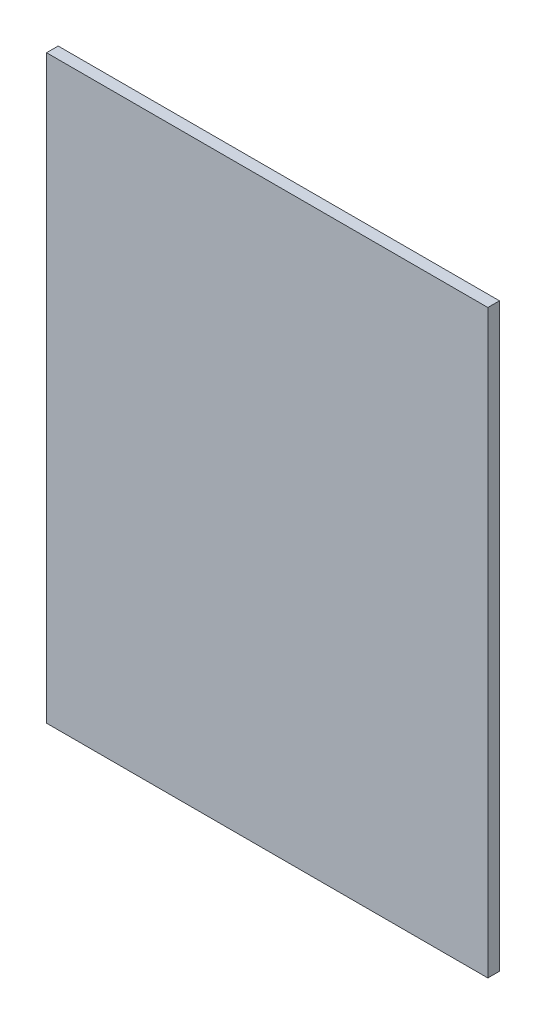
ISO-10303-21;
HEADER;
FILE_DESCRIPTION(('STEP AP214'),'2;1');
FILE_NAME('part.step','',(''),(''),'','','');
FILE_SCHEMA(('AUTOMOTIVE_DESIGN { 1 0 10303 214 1 1 1 1 }'));
ENDSEC;
DATA;
#1=APPLICATION_CONTEXT('core data for automotive mechanical design processes');
#2=APPLICATION_PROTOCOL_DEFINITION('international standard','automotive_design',2000,#1);
#3=PRODUCT_CONTEXT('',#1,'mechanical');
#4=PRODUCT('Part','Part','',(#3));
#5=PRODUCT_RELATED_PRODUCT_CATEGORY('part','',(#4));
#6=PRODUCT_DEFINITION_FORMATION('','',#4);
#7=PRODUCT_DEFINITION_CONTEXT('part definition',#1,'design');
#8=PRODUCT_DEFINITION('design','',#6,#7);
#9=PRODUCT_DEFINITION_SHAPE('','',#8);
#10=(LENGTH_UNIT() NAMED_UNIT(*) SI_UNIT(.MILLI.,.METRE.));
#11=(NAMED_UNIT(*) PLANE_ANGLE_UNIT() SI_UNIT($,.RADIAN.));
#12=(NAMED_UNIT(*) SI_UNIT($,.STERADIAN.) SOLID_ANGLE_UNIT());
#13=UNCERTAINTY_MEASURE_WITH_UNIT(LENGTH_MEASURE(1.E-05),#10,'distance_accuracy_value','');
#14=(GEOMETRIC_REPRESENTATION_CONTEXT(3) GLOBAL_UNCERTAINTY_ASSIGNED_CONTEXT((#13)) GLOBAL_UNIT_ASSIGNED_CONTEXT((#10,
#11,#12)) REPRESENTATION_CONTEXT('',''));
#15=CARTESIAN_POINT('',(0.,0.,0.));
#16=DIRECTION('',(0.,0.,1.));
#17=DIRECTION('',(1.,0.,0.));
#18=AXIS2_PLACEMENT_3D('',#15,#16,#17);
#19=CARTESIAN_POINT('',(190.,0.,5.));
#20=DIRECTION('',(0.,1.,0.));
#21=DIRECTION('',(0.,0.,1.));
#22=AXIS2_PLACEMENT_3D('',#19,#20,#21);
#23=PLANE('',#22);
#24=DIRECTION('',(1.,0.,0.));
#25=VECTOR('',#24,1.);
#26=CARTESIAN_POINT('',(190.,0.,0.));
#27=LINE('',#26,#25);
#28=CARTESIAN_POINT('',(0.,0.,0.));
#29=VERTEX_POINT('',#28);
#30=CARTESIAN_POINT('',(190.,0.,0.));
#31=VERTEX_POINT('',#30);
#32=EDGE_CURVE('E96',#29,#31,#27,.T.);
#33=ORIENTED_EDGE('',*,*,#32,.T.);
#34=DIRECTION('',(0.,0.,-1.));
#35=VECTOR('',#34,1.);
#36=CARTESIAN_POINT('',(190.,0.,5.));
#37=LINE('',#36,#35);
#38=CARTESIAN_POINT('',(190.,0.,5.));
#39=VERTEX_POINT('',#38);
#40=EDGE_CURVE('E11',#39,#31,#37,.T.);
#41=ORIENTED_EDGE('',*,*,#40,.F.);
#42=DIRECTION('',(1.,0.,0.));
#43=VECTOR('',#42,1.);
#44=CARTESIAN_POINT('',(190.,0.,5.));
#45=LINE('',#44,#43);
#46=CARTESIAN_POINT('',(0.,0.,5.));
#47=VERTEX_POINT('',#46);
#48=EDGE_CURVE('E84',#47,#39,#45,.T.);
#49=ORIENTED_EDGE('',*,*,#48,.F.);
#50=DIRECTION('',(0.,0.,-1.));
#51=VECTOR('',#50,1.);
#52=CARTESIAN_POINT('',(0.,0.,5.));
#53=LINE('',#52,#51);
#54=EDGE_CURVE('E92',#47,#29,#53,.T.);
#55=ORIENTED_EDGE('',*,*,#54,.T.);
#56=EDGE_LOOP('',(#33,#41,#49,#55));
#57=FACE_BOUND('',#56,.T.);
#58=ADVANCED_FACE('F33',(#57),#23,.F.);
#59=CARTESIAN_POINT('',(190.,250.,5.));
#60=DIRECTION('',(-1.,0.,0.));
#61=DIRECTION('',(0.,0.,1.));
#62=AXIS2_PLACEMENT_3D('',#59,#60,#61);
#63=PLANE('',#62);
#64=DIRECTION('',(0.,1.,0.));
#65=VECTOR('',#64,1.);
#66=CARTESIAN_POINT('',(190.,250.,0.));
#67=LINE('',#66,#65);
#68=CARTESIAN_POINT('',(190.,250.,0.));
#69=VERTEX_POINT('',#68);
#70=EDGE_CURVE('E88',#31,#69,#67,.T.);
#71=ORIENTED_EDGE('',*,*,#70,.T.);
#72=DIRECTION('',(0.,0.,-1.));
#73=VECTOR('',#72,1.);
#74=CARTESIAN_POINT('',(190.,250.,5.));
#75=LINE('',#74,#73);
#76=CARTESIAN_POINT('',(190.,250.,5.));
#77=VERTEX_POINT('',#76);
#78=EDGE_CURVE('E41',#77,#69,#75,.T.);
#79=ORIENTED_EDGE('',*,*,#78,.F.);
#80=DIRECTION('',(0.,1.,0.));
#81=VECTOR('',#80,1.);
#82=CARTESIAN_POINT('',(190.,250.,5.));
#83=LINE('',#82,#81);
#84=EDGE_CURVE('E79',#39,#77,#83,.T.);
#85=ORIENTED_EDGE('',*,*,#84,.F.);
#86=ORIENTED_EDGE('',*,*,#40,.T.);
#87=EDGE_LOOP('',(#71,#79,#85,#86));
#88=FACE_BOUND('',#87,.T.);
#89=ADVANCED_FACE('F87',(#88),#63,.F.);
#90=CARTESIAN_POINT('',(190.,250.,5.));
#91=DIRECTION('',(0.,-1.,0.));
#92=DIRECTION('',(0.,0.,-1.));
#93=AXIS2_PLACEMENT_3D('',#90,#91,#92);
#94=PLANE('',#93);
#95=DIRECTION('',(-1.,0.,0.));
#96=VECTOR('',#95,1.);
#97=CARTESIAN_POINT('',(190.,250.,0.));
#98=LINE('',#97,#96);
#99=CARTESIAN_POINT('',(0.,250.,0.));
#100=VERTEX_POINT('',#99);
#101=EDGE_CURVE('E66',#69,#100,#98,.T.);
#102=ORIENTED_EDGE('',*,*,#101,.T.);
#103=DIRECTION('',(0.,0.,-1.));
#104=VECTOR('',#103,1.);
#105=CARTESIAN_POINT('',(0.,250.,5.));
#106=LINE('',#105,#104);
#107=CARTESIAN_POINT('',(0.,250.,5.));
#108=VERTEX_POINT('',#107);
#109=EDGE_CURVE('E89',#108,#100,#106,.T.);
#110=ORIENTED_EDGE('',*,*,#109,.F.);
#111=DIRECTION('',(-1.,0.,0.));
#112=VECTOR('',#111,1.);
#113=CARTESIAN_POINT('',(190.,250.,5.));
#114=LINE('',#113,#112);
#115=EDGE_CURVE('E82',#77,#108,#114,.T.);
#116=ORIENTED_EDGE('',*,*,#115,.F.);
#117=ORIENTED_EDGE('',*,*,#78,.T.);
#118=EDGE_LOOP('',(#102,#110,#116,#117));
#119=FACE_BOUND('',#118,.T.);
#120=ADVANCED_FACE('F90',(#119),#94,.F.);
#121=CARTESIAN_POINT('',(0.,0.,5.));
#122=DIRECTION('',(1.,0.,0.));
#123=DIRECTION('',(0.,0.,-1.));
#124=AXIS2_PLACEMENT_3D('',#121,#122,#123);
#125=PLANE('',#124);
#126=DIRECTION('',(0.,-1.,0.));
#127=VECTOR('',#126,1.);
#128=CARTESIAN_POINT('',(0.,0.,0.));
#129=LINE('',#128,#127);
#130=EDGE_CURVE('E72',#100,#29,#129,.T.);
#131=ORIENTED_EDGE('',*,*,#130,.T.);
#132=ORIENTED_EDGE('',*,*,#54,.F.);
#133=DIRECTION('',(0.,-1.,0.));
#134=VECTOR('',#133,1.);
#135=CARTESIAN_POINT('',(0.,0.,5.));
#136=LINE('',#135,#134);
#137=EDGE_CURVE('E49',#108,#47,#136,.T.);
#138=ORIENTED_EDGE('',*,*,#137,.F.);
#139=ORIENTED_EDGE('',*,*,#109,.T.);
#140=EDGE_LOOP('',(#131,#132,#138,#139));
#141=FACE_BOUND('',#140,.T.);
#142=ADVANCED_FACE('F103',(#141),#125,.F.);
#143=CARTESIAN_POINT('',(0.,0.,5.));
#144=DIRECTION('',(0.,0.,-1.));
#145=DIRECTION('',(-1.,0.,0.));
#146=AXIS2_PLACEMENT_3D('',#143,#144,#145);
#147=PLANE('',#146);
#148=ORIENTED_EDGE('',*,*,#48,.T.);
#149=ORIENTED_EDGE('',*,*,#84,.T.);
#150=ORIENTED_EDGE('',*,*,#115,.T.);
#151=ORIENTED_EDGE('',*,*,#137,.T.);
#152=EDGE_LOOP('',(#148,#149,#150,#151));
#153=FACE_BOUND('',#152,.T.);
#154=ADVANCED_FACE('F80',(#153),#147,.F.);
#155=CARTESIAN_POINT('',(0.,0.,0.));
#156=DIRECTION('',(0.,0.,-1.));
#157=DIRECTION('',(-1.,0.,0.));
#158=AXIS2_PLACEMENT_3D('',#155,#156,#157);
#159=PLANE('',#158);
#160=ORIENTED_EDGE('',*,*,#32,.F.);
#161=ORIENTED_EDGE('',*,*,#130,.F.);
#162=ORIENTED_EDGE('',*,*,#101,.F.);
#163=ORIENTED_EDGE('',*,*,#70,.F.);
#164=EDGE_LOOP('',(#160,#161,#162,#163));
#165=FACE_BOUND('',#164,.T.);
#166=ADVANCED_FACE('F106',(#165),#159,.T.);
#167=CLOSED_SHELL('',(#58,#89,#120,#142,#154,#166));
#168=MANIFOLD_SOLID_BREP('B2',#167);
#169=ADVANCED_BREP_SHAPE_REPRESENTATION('',(#18,#168),#14);
#170=SHAPE_DEFINITION_REPRESENTATION(#9,#169);
ENDSEC;
END-ISO-10303-21;
